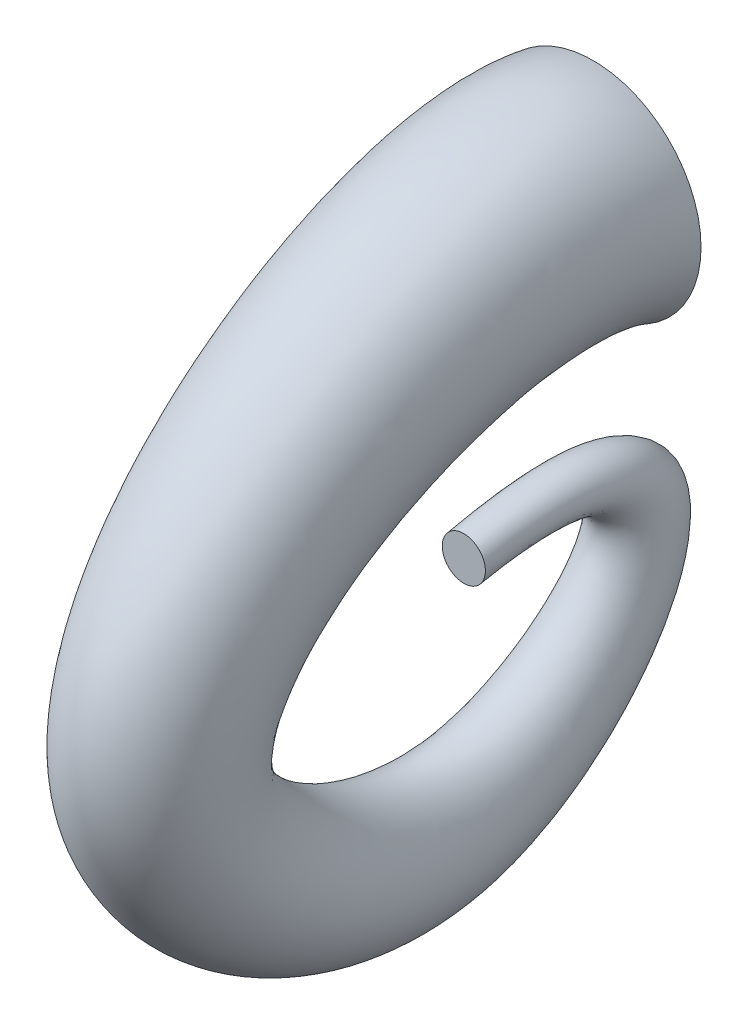
ISO-10303-21;
HEADER;
FILE_DESCRIPTION(('STEP AP214'),'2;1');
FILE_NAME('part.step','',(''),(''),'','','');
FILE_SCHEMA(('AUTOMOTIVE_DESIGN { 1 0 10303 214 1 1 1 1 }'));
ENDSEC;
DATA;
#1=APPLICATION_CONTEXT('core data for automotive mechanical design processes');
#2=APPLICATION_PROTOCOL_DEFINITION('international standard','automotive_design',2000,#1);
#3=PRODUCT_CONTEXT('',#1,'mechanical');
#4=PRODUCT('Part','Part','',(#3));
#5=PRODUCT_RELATED_PRODUCT_CATEGORY('part','',(#4));
#6=PRODUCT_DEFINITION_FORMATION('','',#4);
#7=PRODUCT_DEFINITION_CONTEXT('part definition',#1,'design');
#8=PRODUCT_DEFINITION('design','',#6,#7);
#9=PRODUCT_DEFINITION_SHAPE('','',#8);
#10=(LENGTH_UNIT() NAMED_UNIT(*) SI_UNIT(.MILLI.,.METRE.));
#11=(NAMED_UNIT(*) PLANE_ANGLE_UNIT() SI_UNIT($,.RADIAN.));
#12=(NAMED_UNIT(*) SI_UNIT($,.STERADIAN.) SOLID_ANGLE_UNIT());
#13=UNCERTAINTY_MEASURE_WITH_UNIT(LENGTH_MEASURE(1.E-05),#10,'distance_accuracy_value','');
#14=(GEOMETRIC_REPRESENTATION_CONTEXT(3) GLOBAL_UNCERTAINTY_ASSIGNED_CONTEXT((#13)) GLOBAL_UNIT_ASSIGNED_CONTEXT((#10,
#11,#12)) REPRESENTATION_CONTEXT('',''));
#15=CARTESIAN_POINT('',(0.,0.,0.));
#16=DIRECTION('',(0.,0.,1.));
#17=DIRECTION('',(1.,0.,0.));
#18=AXIS2_PLACEMENT_3D('',#15,#16,#17);
#19=CARTESIAN_POINT('',(0.,88.9,-38.1));
#20=DIRECTION('',(0.,0.,1.));
#21=DIRECTION('',(1.,0.,0.));
#22=AXIS2_PLACEMENT_3D('',#19,#20,#21);
#23=PLANE('',#22);
#24=CARTESIAN_POINT('',(0.,88.9,-38.1));
#25=DIRECTION('',(0.,0.,1.));
#26=DIRECTION('',(1.,0.,0.));
#27=AXIS2_PLACEMENT_3D('',#24,#25,#26);
#28=CIRCLE('',#27,31.75);
#29=CARTESIAN_POINT('',(31.75,88.9,-38.1));
#30=VERTEX_POINT('',#29);
#31=EDGE_CURVE('E12',#30,#30,#28,.T.);
#32=ORIENTED_EDGE('',*,*,#31,.F.);
#33=EDGE_LOOP('',(#32));
#34=FACE_BOUND('',#33,.T.);
#35=ADVANCED_FACE('F88',(#34),#23,.F.);
#36=CARTESIAN_POINT('',(0.,0.,0.));
#37=DIRECTION('',(0.,0.,1.));
#38=DIRECTION('',(1.,0.,0.));
#39=AXIS2_PLACEMENT_3D('',#36,#37,#38);
#40=PLANE('',#39);
#41=CARTESIAN_POINT('',(0.,12.7,0.));
#42=DIRECTION('',(0.,0.,1.));
#43=DIRECTION('',(1.,0.,0.));
#44=AXIS2_PLACEMENT_3D('',#41,#42,#43);
#45=CIRCLE('',#44,6.35);
#46=CARTESIAN_POINT('',(6.35,12.7,0.));
#47=VERTEX_POINT('',#46);
#48=EDGE_CURVE('E96',#47,#47,#45,.T.);
#49=ORIENTED_EDGE('',*,*,#48,.T.);
#50=EDGE_LOOP('',(#49));
#51=FACE_BOUND('',#50,.T.);
#52=ADVANCED_FACE('F120',(#51),#40,.T.);
#53=CARTESIAN_POINT('',(0.,19.05,0.));
#54=CARTESIAN_POINT('',(0.,39.5023173920752,-103.794441428933));
#55=CARTESIAN_POINT('',(0.,-50.7782227189179,-60.6401874218214));
#56=CARTESIAN_POINT('',(0.,-83.2418300528822,42.1533021035655));
#57=CARTESIAN_POINT('',(0.,-46.8916623747579,100.510959947666));
#58=CARTESIAN_POINT('',(0.,60.4833470880495,133.275887320275));
#59=CARTESIAN_POINT('',(0.,135.476895126784,24.4103513130446));
#60=CARTESIAN_POINT('',(0.,120.65,-38.1));
#61=CARTESIAN_POINT('',(0.415606524814644,19.05,0.));
#62=CARTESIAN_POINT('',(0.588506252056333,39.5023173920752,-103.794441428933));
#63=CARTESIAN_POINT('',(0.766979328931513,-50.7782227189179,-60.6401874218214));
#64=CARTESIAN_POINT('',(1.07901934399031,-83.2418300528822,42.1533021035655));
#65=CARTESIAN_POINT('',(1.23336523188843,-46.8916623747579,100.510959947666));
#66=CARTESIAN_POINT('',(1.60903418809944,60.4833470880495,133.275887320275));
#67=CARTESIAN_POINT('',(1.85113620612683,135.476895126784,24.4103513130446));
#68=CARTESIAN_POINT('',(2.07803262407322,120.65,-38.1));
#69=CARTESIAN_POINT('',(1.24673444727475,18.9674430750039,0.));
#70=CARTESIAN_POINT('',(1.76543626701773,39.3919695013015,-103.488030680534));
#71=CARTESIAN_POINT('',(2.30085822069658,-50.5483172481614,-60.4319133687042));
#72=CARTESIAN_POINT('',(3.23698302682409,-82.8384675256928,42.0534996033567));
#73=CARTESIAN_POINT('',(3.70002304545113,-46.6049744878223,100.219012022441));
#74=CARTESIAN_POINT('',(4.82703564585397,60.3620548980935,132.745055095399));
#75=CARTESIAN_POINT('',(5.55334539380815,135.045483844224,24.1494699590034));
#76=CARTESIAN_POINT('',(6.23403810951982,120.240788903065,-38.1));
#77=CARTESIAN_POINT('',(2.44589267626068,18.6051069321988,0.));
#78=CARTESIAN_POINT('',(3.46333302122532,38.9036896448158,-102.224086343391));
#79=CARTESIAN_POINT('',(4.51357012570007,-49.644722411665,-59.5727828995958));
#80=CARTESIAN_POINT('',(6.34979107080545,-81.2397667483422,41.6418142899953));
#81=CARTESIAN_POINT('',(7.25805007116478,-45.4976493386556,99.0147268308891));
#82=CARTESIAN_POINT('',(9.46869989981112,59.7618970921492,130.555372167787));
#83=CARTESIAN_POINT('',(10.8933658878268,133.150253636952,23.0733343735832));
#84=CARTESIAN_POINT('',(12.2285534756239,118.422297617221,-38.1000000000001));
#85=CARTESIAN_POINT('',(3.55023897734567,18.0134400537597,0.));
#86=CARTESIAN_POINT('',(5.02739911964864,38.1058579680826,-100.27071782235));
#87=CARTESIAN_POINT('',(6.55217489483346,-48.3033710187635,-58.2450358109736));
#88=CARTESIAN_POINT('',(9.21807310301371,-78.8449595341722,41.0055733511642));
#89=CARTESIAN_POINT('',(10.5367194500537,-43.8725286425832,97.1535588075813));
#90=CARTESIAN_POINT('',(13.7462283235973,58.7231405356425,127.171316734205));
#91=CARTESIAN_POINT('',(15.8146147641454,130.093884406066,21.4102157415705));
#92=CARTESIAN_POINT('',(17.7530929235308,115.469401275124,-38.0999999999999));
#93=CARTESIAN_POINT('',(4.51949841605828,17.2194795353853,0.));
#94=CARTESIAN_POINT('',(6.39947715830029,37.0321635198874,-97.7428291480631));
#95=CARTESIAN_POINT('',(8.34005622074638,-46.6220602036922,-56.5267748727567));
#96=CARTESIAN_POINT('',(11.7329395086384,-75.8236926890672,40.1822027244414));
#97=CARTESIAN_POINT('',(13.4111780624524,-41.858871353021,94.744988424477));
#98=CARTESIAN_POINT('',(17.4959135508416,57.2613282538139,122.79195087898));
#99=CARTESIAN_POINT('',(20.1283448137849,126.002935389392,19.2579445707303));
#100=CARTESIAN_POINT('',(22.5954420685642,111.495387119073,-38.1000000000001));
#101=CARTESIAN_POINT('',(5.31339605792705,16.2502624727742,0.));
#102=CARTESIAN_POINT('',(7.52411544969849,35.7204067040415,-94.755324351178));
#103=CARTESIAN_POINT('',(9.80609644672775,-44.6902318628429,-54.496102854864));
#104=CARTESIAN_POINT('',(13.7958824533583,-72.3298378313398,39.2091283474055));
#105=CARTESIAN_POINT('',(15.7693699357277,-39.5664910695719,91.8984961535357));
#106=CARTESIAN_POINT('',(20.572724224548,55.4203815978839,117.616336686442));
#107=CARTESIAN_POINT('',(23.6682735037669,121.038101055997,16.7143513688284));
#108=CARTESIAN_POINT('',(26.5694019154756,106.653072956324,-38.1));
#109=CARTESIAN_POINT('',(5.9050471605683,15.1459513294715,0.));
#110=CARTESIAN_POINT('',(8.36135004926656,34.2236068236755,-91.4231074623446));
#111=CARTESIAN_POINT('',(10.896830823453,-42.5799479777133,-52.2311225272145));
#112=CARTESIAN_POINT('',(15.3298325557632,-68.4961083727782,38.1237761576346));
#113=CARTESIAN_POINT('',(17.5225500131649,-37.0821743103364,88.7235624667164));
#114=CARTESIAN_POINT('',(22.8594973702043,53.2717977340854,111.843536240918));
#115=CARTESIAN_POINT('',(26.2989237691199,115.390583147413,13.87726664363));
#116=CARTESIAN_POINT('',(29.5223315542457,101.128531209233,-38.1000000000001));
#117=CARTESIAN_POINT('',(6.26756698159834,13.9467085690224,0.));
#118=CARTESIAN_POINT('',(8.87528796923964,32.5975097784664,-87.8610825122124));
#119=CARTESIAN_POINT('',(11.5670677407933,-40.3577294460212,-49.809936659727));
#120=CARTESIAN_POINT('',(16.2733406148695,-64.4447558283801,36.9635720927072));
#121=CARTESIAN_POINT('',(18.6012275216281,-34.4798116906746,85.3296678359787));
#122=CARTESIAN_POINT('',(24.2671694935744,50.9058939609721,105.672611626739));
#123=CARTESIAN_POINT('',(27.9186183629982,109.274221441297,10.8445209029008));
#124=CARTESIAN_POINT('',(31.3407322120983,95.1340504505981,-38.0999999999999));
#125=CARTESIAN_POINT('',(6.39154407171055,12.7,0.));
#126=CARTESIAN_POINT('',(9.05022975121634,30.9062857109592,-84.1841535314307));
#127=CARTESIAN_POINT('',(11.7946170399371,-38.0805158931082,-47.3106480223206));
#128=CARTESIAN_POINT('',(16.5928682153708,-60.2864275053668,35.7659420902014));
#129=CARTESIAN_POINT('',(18.9662508018668,-31.8206890036803,81.8262927332815));
#130=CARTESIAN_POINT('',(24.7429266245935,48.4280278371076,99.30262492823));
#131=CARTESIAN_POINT('',(28.4657385606072,102.919465507166,7.71394465440593));
#132=CARTESIAN_POINT('',(31.9547334060528,88.9000000000001,-38.1000000000001));
#133=CARTESIAN_POINT('',(6.26756698159833,11.4532914309776,0.));
#134=CARTESIAN_POINT('',(8.87528796923964,29.215061643452,-80.5072245506491));
#135=CARTESIAN_POINT('',(11.5670677407933,-35.8033023401953,-44.8113593849142));
#136=CARTESIAN_POINT('',(16.2733406148695,-56.1280991823537,34.5683120876957));
#137=CARTESIAN_POINT('',(18.6012275216281,-29.161566316686,78.3229176305846));
#138=CARTESIAN_POINT('',(24.2671694935744,45.950161713243,92.9326382297217));
#139=CARTESIAN_POINT('',(27.9186183629982,96.564709573036,4.58336840591136));
#140=CARTESIAN_POINT('',(31.3407322120983,82.6659495494019,-38.0999999999999));
#141=CARTESIAN_POINT('',(5.90504716056829,10.2540486705285,0.));
#142=CARTESIAN_POINT('',(8.36135004926656,27.5889645982429,-76.9451996005168));
#143=CARTESIAN_POINT('',(10.896830823453,-33.5810838085032,-42.3901735174268));
#144=CARTESIAN_POINT('',(15.3298325557632,-52.0767466379556,33.4081080227681));
#145=CARTESIAN_POINT('',(17.5225500131649,-26.5592036970243,74.9290229998467));
#146=CARTESIAN_POINT('',(22.8594973702044,43.5842579401296,86.7617136155415));
#147=CARTESIAN_POINT('',(26.2989237691199,90.4483478669197,1.55062266518186));
#148=CARTESIAN_POINT('',(29.5223315542457,76.6714687907667,-38.1000000000002));
#149=CARTESIAN_POINT('',(5.31339605792705,9.14973752722581,0.));
#150=CARTESIAN_POINT('',(7.52411544969849,26.0921647178769,-73.6129827116834));
#151=CARTESIAN_POINT('',(9.80609644672775,-31.4707999233736,-40.1251931897772));
#152=CARTESIAN_POINT('',(13.7958824533583,-48.2430171793939,32.3227558329974));
#153=CARTESIAN_POINT('',(15.7693699357277,-24.0748869377888,71.7540893130276));
#154=CARTESIAN_POINT('',(20.572724224548,41.4356740763313,80.9889131700184));
#155=CARTESIAN_POINT('',(23.6682735037669,84.8008299583359,-1.28646206001624));
#156=CARTESIAN_POINT('',(26.5694019154756,71.1469270436762,-38.0999999999999));
#157=CARTESIAN_POINT('',(4.51949841605828,8.1805204646147,0.));
#158=CARTESIAN_POINT('',(6.39947715830029,24.780407902031,-70.6254779147984));
#159=CARTESIAN_POINT('',(8.34005622074638,-29.5389715825243,-38.0945211718846));
#160=CARTESIAN_POINT('',(11.7329395086384,-44.7491623216665,31.3496814559614));
#161=CARTESIAN_POINT('',(13.4111780624524,-21.7825066543397,68.9075970420861));
#162=CARTESIAN_POINT('',(17.4959135508416,39.5947274204012,75.8132989774802));
#163=CARTESIAN_POINT('',(20.1283448137849,79.8359956249407,-3.83005526191838));
#164=CARTESIAN_POINT('',(22.5954420685642,66.3046128809273,-38.1000000000001));
#165=CARTESIAN_POINT('',(3.55023897734568,7.38655994624031,0.));
#166=CARTESIAN_POINT('',(5.02739911964866,23.7067134538358,-68.097589240511));
#167=CARTESIAN_POINT('',(6.55217489483348,-27.8576607674529,-36.3762602336677));
#168=CARTESIAN_POINT('',(9.21807310301374,-41.7278954765614,30.5263108292387));
#169=CARTESIAN_POINT('',(10.5367194500537,-19.7688493647772,66.4990266589819));
#170=CARTESIAN_POINT('',(13.7462283235973,38.1329151385729,71.4339331222557));
#171=CARTESIAN_POINT('',(15.8146147641454,75.7450466082674,-5.98232643275849));
#172=CARTESIAN_POINT('',(17.7530929235309,62.3305987248769,-38.1));
#173=CARTESIAN_POINT('',(2.44589267626069,6.79489306780125,0.));
#174=CARTESIAN_POINT('',(3.46333302122534,22.9088817771025,-66.1442207194707));
#175=CARTESIAN_POINT('',(4.51357012570009,-26.5163093745516,-35.0485131450455));
#176=CARTESIAN_POINT('',(6.34979107080547,-39.3330882623917,29.8900698904075));
#177=CARTESIAN_POINT('',(7.2580500711648,-18.1437286687053,64.6378586356741));
#178=CARTESIAN_POINT('',(9.46869989981114,37.0941585820656,68.0498776886731));
#179=CARTESIAN_POINT('',(10.8933658878269,72.6886773773797,-7.64544506477123));
#180=CARTESIAN_POINT('',(12.228553475624,59.3777023827785,-38.0999999999999));
#181=CARTESIAN_POINT('',(1.24673444727475,6.43255692499607,0.));
#182=CARTESIAN_POINT('',(1.76543626701774,22.4206019206169,-64.880276382327));
#183=CARTESIAN_POINT('',(2.30085822069659,-25.612714538055,-34.1893826759371));
#184=CARTESIAN_POINT('',(3.2369830268241,-37.7343874850407,29.4783845770461));
#185=CARTESIAN_POINT('',(3.70002304545113,-17.0364035195382,63.433573444122));
#186=CARTESIAN_POINT('',(4.82703564585398,36.4940007761218,65.8601947610608));
#187=CARTESIAN_POINT('',(5.55334539380815,70.7934471701092,-8.72158065019142));
#188=CARTESIAN_POINT('',(6.23403810951982,57.5592110969355,-38.1000000000001));
#189=CARTESIAN_POINT('',(0.415606524814642,6.35,0.));
#190=CARTESIAN_POINT('',(0.588506252056332,22.3102540298431,-64.5738656339285));
#191=CARTESIAN_POINT('',(0.766979328931513,-25.3828090672987,-33.9811086228199));
#192=CARTESIAN_POINT('',(1.07901934399031,-37.3310249578515,29.3785820768373));
#193=CARTESIAN_POINT('',(1.23336523188843,-16.7497156326027,63.1416255188972));
#194=CARTESIAN_POINT('',(1.60903418809944,36.3727085861657,65.3293625361851));
#195=CARTESIAN_POINT('',(1.85113620612683,70.3620358875482,-8.9824620042326));
#196=CARTESIAN_POINT('',(2.07803262407321,57.15,-38.1));
#197=CARTESIAN_POINT('',(-0.415606524814645,6.35,0.));
#198=CARTESIAN_POINT('',(-0.588506252056332,22.3102540298431,-64.5738656339285));
#199=CARTESIAN_POINT('',(-0.766979328931513,-25.3828090672987,-33.9811086228199));
#200=CARTESIAN_POINT('',(-1.07901934399031,-37.3310249578515,29.3785820768373));
#201=CARTESIAN_POINT('',(-1.23336523188843,-16.7497156326027,63.1416255188972));
#202=CARTESIAN_POINT('',(-1.60903418809944,36.3727085861657,65.3293625361851));
#203=CARTESIAN_POINT('',(-1.85113620612683,70.3620358875482,-8.9824620042326));
#204=CARTESIAN_POINT('',(-2.07803262407322,57.15,-38.1));
#205=CARTESIAN_POINT('',(-1.24673444727475,6.43255692499607,0.));
#206=CARTESIAN_POINT('',(-1.76543626701773,22.4206019206169,-64.8802763823269));
#207=CARTESIAN_POINT('',(-2.30085822069658,-25.612714538055,-34.189382675937));
#208=CARTESIAN_POINT('',(-3.23698302682409,-37.7343874850407,29.4783845770462));
#209=CARTESIAN_POINT('',(-3.70002304545113,-17.0364035195381,63.433573444122));
#210=CARTESIAN_POINT('',(-4.82703564585397,36.4940007761219,65.8601947610609));
#211=CARTESIAN_POINT('',(-5.55334539380815,70.7934471701093,-8.72158065019129));
#212=CARTESIAN_POINT('',(-6.23403810951983,57.5592110969355,-38.0999999999999));
#213=CARTESIAN_POINT('',(-2.44589267626068,6.79489306780124,0.));
#214=CARTESIAN_POINT('',(-3.46333302122532,22.9088817771025,-66.1442207194707));
#215=CARTESIAN_POINT('',(-4.51357012570006,-26.5163093745516,-35.0485131450455));
#216=CARTESIAN_POINT('',(-6.34979107080543,-39.3330882623917,29.8900698904075));
#217=CARTESIAN_POINT('',(-7.25805007116475,-18.1437286687053,64.637858635674));
#218=CARTESIAN_POINT('',(-9.46869989981108,37.0941585820655,68.049877688673));
#219=CARTESIAN_POINT('',(-10.8933658878268,72.6886773773796,-7.64544506477141));
#220=CARTESIAN_POINT('',(-12.2285534756239,59.3777023827784,-38.1000000000001));
#221=CARTESIAN_POINT('',(-3.55023897734568,7.38655994624032,0.));
#222=CARTESIAN_POINT('',(-5.02739911964865,23.7067134538358,-68.0975892405109));
#223=CARTESIAN_POINT('',(-6.55217489483348,-27.8576607674529,-36.3762602336676));
#224=CARTESIAN_POINT('',(-9.21807310301374,-41.7278954765614,30.5263108292388));
#225=CARTESIAN_POINT('',(-10.5367194500537,-19.7688493647772,66.499026658982));
#226=CARTESIAN_POINT('',(-13.7462283235973,38.1329151385729,71.4339331222558));
#227=CARTESIAN_POINT('',(-15.8146147641454,75.7450466082673,-5.98232643275832));
#228=CARTESIAN_POINT('',(-17.7530929235309,62.3305987248769,-38.0999999999998));
#229=CARTESIAN_POINT('',(-4.51949841605829,8.18052046461471,0.));
#230=CARTESIAN_POINT('',(-6.39947715830029,24.780407902031,-70.6254779147983));
#231=CARTESIAN_POINT('',(-8.34005622074638,-29.5389715825243,-38.0945211718846));
#232=CARTESIAN_POINT('',(-11.7329395086384,-44.7491623216664,31.3496814559613));
#233=CARTESIAN_POINT('',(-13.4111780624524,-21.7825066543396,68.9075970420861));
#234=CARTESIAN_POINT('',(-17.4959135508416,39.5947274204013,75.8132989774801));
#235=CARTESIAN_POINT('',(-20.1283448137849,79.8359956249408,-3.83005526191846));
#236=CARTESIAN_POINT('',(-22.5954420685642,66.3046128809274,-38.1000000000001));
#237=CARTESIAN_POINT('',(-5.31339605792704,9.1497375272258,0.));
#238=CARTESIAN_POINT('',(-7.52411544969848,26.0921647178769,-73.6129827116834));
#239=CARTESIAN_POINT('',(-9.80609644672774,-31.4707999233737,-40.1251931897773));
#240=CARTESIAN_POINT('',(-13.7958824533583,-48.243017179394,32.3227558329973));
#241=CARTESIAN_POINT('',(-15.7693699357277,-24.0748869377889,71.7540893130276));
#242=CARTESIAN_POINT('',(-20.5727242245479,41.4356740763311,80.9889131700183));
#243=CARTESIAN_POINT('',(-23.6682735037668,84.8008299583357,-1.28646206001635));
#244=CARTESIAN_POINT('',(-26.5694019154755,71.146927043676,-38.1));
#245=CARTESIAN_POINT('',(-5.90504716056828,10.2540486705285,0.));
#246=CARTESIAN_POINT('',(-8.36135004926655,27.5889645982429,-76.9451996005168));
#247=CARTESIAN_POINT('',(-10.8968308234529,-33.5810838085032,-42.3901735174268));
#248=CARTESIAN_POINT('',(-15.3298325557632,-52.0767466379554,33.4081080227682));
#249=CARTESIAN_POINT('',(-17.5225500131649,-26.5592036970241,74.9290229998468));
#250=CARTESIAN_POINT('',(-22.8594973702043,43.5842579401299,86.7617136155416));
#251=CARTESIAN_POINT('',(-26.2989237691199,90.44834786692,1.55062266518203));
#252=CARTESIAN_POINT('',(-29.5223315542457,76.6714687907671,-38.1));
#253=CARTESIAN_POINT('',(-6.26756698159834,11.4532914309776,0.));
#254=CARTESIAN_POINT('',(-8.87528796923965,29.215061643452,-80.507224550649));
#255=CARTESIAN_POINT('',(-11.5670677407933,-35.8033023401953,-44.8113593849143));
#256=CARTESIAN_POINT('',(-16.2733406148696,-56.1280991823537,34.5683120876956));
#257=CARTESIAN_POINT('',(-18.6012275216281,-29.1615663166861,78.3229176305846));
#258=CARTESIAN_POINT('',(-24.2671694935745,45.9501617132429,92.9326382297216));
#259=CARTESIAN_POINT('',(-27.9186183629983,96.5647095730359,4.58336840591121));
#260=CARTESIAN_POINT('',(-31.3407322120984,82.6659495494018,-38.1000000000001));
#261=CARTESIAN_POINT('',(-6.39154407171057,12.7,0.));
#262=CARTESIAN_POINT('',(-9.05022975121634,30.9062857109592,-84.1841535314307));
#263=CARTESIAN_POINT('',(-11.7946170399371,-38.0805158931083,-47.3106480223206));
#264=CARTESIAN_POINT('',(-16.5928682153707,-60.2864275053669,35.7659420902014));
#265=CARTESIAN_POINT('',(-18.9662508018667,-31.8206890036804,81.8262927332817));
#266=CARTESIAN_POINT('',(-24.7429266245934,48.4280278371075,99.3026249282301));
#267=CARTESIAN_POINT('',(-28.4657385606071,102.919465507166,7.71394465440603));
#268=CARTESIAN_POINT('',(-31.9547334060527,88.8999999999999,-38.1));
#269=CARTESIAN_POINT('',(-6.26756698159833,13.9467085690224,0.));
#270=CARTESIAN_POINT('',(-8.87528796923965,32.5975097784664,-87.8610825122123));
#271=CARTESIAN_POINT('',(-11.5670677407933,-40.3577294460212,-49.8099366597271));
#272=CARTESIAN_POINT('',(-16.2733406148696,-64.44475582838,36.9635720927072));
#273=CARTESIAN_POINT('',(-18.6012275216281,-34.4798116906746,85.3296678359788));
#274=CARTESIAN_POINT('',(-24.2671694935745,50.9058939609722,105.672611626738));
#275=CARTESIAN_POINT('',(-27.9186183629983,109.274221441297,10.8445209029007));
#276=CARTESIAN_POINT('',(-31.3407322120984,95.1340504505982,-38.1));
#277=CARTESIAN_POINT('',(-5.90504716056827,15.1459513294715,0.));
#278=CARTESIAN_POINT('',(-8.36135004926654,34.2236068236754,-91.4231074623446));
#279=CARTESIAN_POINT('',(-10.8968308234529,-42.5799479777133,-52.2311225272145));
#280=CARTESIAN_POINT('',(-15.3298325557632,-68.4961083727783,38.1237761576346));
#281=CARTESIAN_POINT('',(-17.5225500131649,-37.0821743103366,88.7235624667166));
#282=CARTESIAN_POINT('',(-22.8594973702043,53.2717977340851,111.843536240919));
#283=CARTESIAN_POINT('',(-26.2989237691199,115.390583147412,13.87726664363));
#284=CARTESIAN_POINT('',(-29.5223315542457,101.128531209233,-38.1));
#285=CARTESIAN_POINT('',(-5.31339605792704,16.2502624727742,0.));
#286=CARTESIAN_POINT('',(-7.5241154496985,35.7204067040415,-94.7553243511779));
#287=CARTESIAN_POINT('',(-9.80609644672777,-44.6902318628428,-54.496102854864));
#288=CARTESIAN_POINT('',(-13.7958824533584,-72.3298378313397,39.2091283474055));
#289=CARTESIAN_POINT('',(-15.7693699357278,-39.5664910695717,91.8984961535358));
#290=CARTESIAN_POINT('',(-20.572724224548,55.4203815978841,117.616336686442));
#291=CARTESIAN_POINT('',(-23.6682735037669,121.038101055997,16.7143513688284));
#292=CARTESIAN_POINT('',(-26.5694019154756,106.653072956324,-38.1));
#293=CARTESIAN_POINT('',(-4.5194984160583,17.2194795353853,0.));
#294=CARTESIAN_POINT('',(-6.39947715830029,37.0321635198873,-97.742829148063));
#295=CARTESIAN_POINT('',(-8.34005622074638,-46.6220602036922,-56.5267748727567));
#296=CARTESIAN_POINT('',(-11.7329395086384,-75.8236926890674,40.1822027244414));
#297=CARTESIAN_POINT('',(-13.4111780624524,-41.8588713530212,94.7449884244772));
#298=CARTESIAN_POINT('',(-17.4959135508416,57.2613282538135,122.79195087898));
#299=CARTESIAN_POINT('',(-20.1283448137849,126.002935389391,19.2579445707303));
#300=CARTESIAN_POINT('',(-22.5954420685641,111.495387119072,-38.1));
#301=CARTESIAN_POINT('',(-3.55023897734568,18.0134400537597,0.));
#302=CARTESIAN_POINT('',(-5.02739911964866,38.1058579680827,-100.27071782235));
#303=CARTESIAN_POINT('',(-6.55217489483348,-48.3033710187634,-58.2450358109736));
#304=CARTESIAN_POINT('',(-9.21807310301375,-78.8449595341721,41.0055733511641));
#305=CARTESIAN_POINT('',(-10.5367194500537,-43.8725286425832,97.1535588075814));
#306=CARTESIAN_POINT('',(-13.7462283235973,58.7231405356426,127.171316734204));
#307=CARTESIAN_POINT('',(-15.8146147641455,130.093884406066,21.4102157415704));
#308=CARTESIAN_POINT('',(-17.7530929235309,115.469401275124,-38.1));
#309=CARTESIAN_POINT('',(-2.44589267626067,18.6051069321988,0.));
#310=CARTESIAN_POINT('',(-3.46333302122532,38.9036896448158,-102.224086343391));
#311=CARTESIAN_POINT('',(-4.51357012570006,-49.644722411665,-59.5727828995958));
#312=CARTESIAN_POINT('',(-6.34979107080543,-81.2397667483422,41.6418142899953));
#313=CARTESIAN_POINT('',(-7.25805007116475,-45.4976493386556,99.0147268308892));
#314=CARTESIAN_POINT('',(-9.46869989981108,59.7618970921493,130.555372167787));
#315=CARTESIAN_POINT('',(-10.8933658878268,133.150253636953,23.0733343735833));
#316=CARTESIAN_POINT('',(-12.2285534756239,118.422297617221,-38.1));
#317=CARTESIAN_POINT('',(-1.24673444727475,18.9674430750039,0.));
#318=CARTESIAN_POINT('',(-1.76543626701773,39.3919695013015,-103.488030680534));
#319=CARTESIAN_POINT('',(-2.30085822069659,-50.5483172481614,-60.4319133687042));
#320=CARTESIAN_POINT('',(-3.2369830268241,-82.8384675256929,42.0534996033567));
#321=CARTESIAN_POINT('',(-3.70002304545114,-46.6049744878224,100.219012022441));
#322=CARTESIAN_POINT('',(-4.82703564585399,60.3620548980934,132.745055095399));
#323=CARTESIAN_POINT('',(-5.55334539380817,135.045483844223,24.1494699590034));
#324=CARTESIAN_POINT('',(-6.23403810951984,120.240788903065,-38.1));
#325=CARTESIAN_POINT('',(-0.415606524814643,19.05,0.));
#326=CARTESIAN_POINT('',(-0.588506252056333,39.5023173920752,-103.794441428933));
#327=CARTESIAN_POINT('',(-0.766979328931513,-50.7782227189179,-60.6401874218214));
#328=CARTESIAN_POINT('',(-1.07901934399031,-83.2418300528822,42.1533021035655));
#329=CARTESIAN_POINT('',(-1.23336523188843,-46.8916623747579,100.510959947666));
#330=CARTESIAN_POINT('',(-1.60903418809944,60.4833470880495,133.275887320275));
#331=CARTESIAN_POINT('',(-1.85113620612683,135.476895126784,24.4103513130446));
#332=CARTESIAN_POINT('',(-2.07803262407322,120.65,-38.1));
#333=CARTESIAN_POINT('',(0.,19.05,0.));
#334=CARTESIAN_POINT('',(0.,39.5023173920752,-103.794441428933));
#335=CARTESIAN_POINT('',(0.,-50.7782227189179,-60.6401874218214));
#336=CARTESIAN_POINT('',(0.,-83.2418300528822,42.1533021035655));
#337=CARTESIAN_POINT('',(0.,-46.8916623747579,100.510959947666));
#338=CARTESIAN_POINT('',(0.,60.4833470880495,133.275887320275));
#339=CARTESIAN_POINT('',(0.,135.476895126784,24.4103513130446));
#340=CARTESIAN_POINT('',(0.,120.65,-38.1));
#341=B_SPLINE_SURFACE_WITH_KNOTS('',3,3,((#53,#54,#55,#56,#57,#58,#59,#60),(#61,#62,#63,#64,#65,
#66,#67,#68),(#69,#70,#71,#72,#73,#74,#75,#76),(#77,#78,#79,#80,#81,#82,#83,#84),(#85,#86,#87,
#88,#89,#90,#91,#92),(#93,#94,#95,#96,#97,#98,#99,#100),(#101,#102,#103,#104,#105,#106,#107,
#108),(#109,#110,#111,#112,#113,#114,#115,#116),(#117,#118,#119,#120,#121,#122,#123,#124),(#125,
#126,#127,#128,#129,#130,#131,#132),(#133,#134,#135,#136,#137,#138,#139,#140),(#141,#142,#143,
#144,#145,#146,#147,#148),(#149,#150,#151,#152,#153,#154,#155,#156),(#157,#158,#159,#160,#161,
#162,#163,#164),(#165,#166,#167,#168,#169,#170,#171,#172),(#173,#174,#175,#176,#177,#178,#179,
#180),(#181,#182,#183,#184,#185,#186,#187,#188),(#189,#190,#191,#192,#193,#194,#195,#196),(#197,
#198,#199,#200,#201,#202,#203,#204),(#205,#206,#207,#208,#209,#210,#211,#212),(#213,#214,#215,
#216,#217,#218,#219,#220),(#221,#222,#223,#224,#225,#226,#227,#228),(#229,#230,#231,#232,#233,
#234,#235,#236),(#237,#238,#239,#240,#241,#242,#243,#244),(#245,#246,#247,#248,#249,#250,#251,
#252),(#253,#254,#255,#256,#257,#258,#259,#260),(#261,#262,#263,#264,#265,#266,#267,#268),(#269,
#270,#271,#272,#273,#274,#275,#276),(#277,#278,#279,#280,#281,#282,#283,#284),(#285,#286,#287,
#288,#289,#290,#291,#292),(#293,#294,#295,#296,#297,#298,#299,#300),(#301,#302,#303,#304,#305,
#306,#307,#308),(#309,#310,#311,#312,#313,#314,#315,#316),(#317,#318,#319,#320,#321,#322,#323,
#324),(#325,#326,#327,#328,#329,#330,#331,#332),(#333,#334,#335,#336,#337,#338,#339,#340)),
.UNSPECIFIED.,.T.,.F.,.F.,(4,1,1,1,1,1,1,1,1,1,1,1,1,1,1,1,2,1,1,1,1,1,1,1,1,1,1,1,1,1,1,1,4),
(4,1,1,1,1,4),(0.,0.03125,0.0625,0.09375,0.125,0.15625,0.1875,0.21875,0.25,0.28125,0.3125,
0.34375,0.375,0.40625,0.4375,0.46875,0.5,0.53125,0.5625,0.59375,0.625,0.65625,0.6875,0.71875,
0.75,0.78125,0.8125,0.84375,0.875,0.90625,0.9375,0.96875,1.),(0.,0.312013377290216,
0.322070996638187,0.563104757314562,0.590544653899065,1.),.UNSPECIFIED.);
#342=ORIENTED_EDGE('',*,*,#48,.F.);
#343=EDGE_LOOP('',(#342));
#344=FACE_BOUND('',#343,.T.);
#345=ORIENTED_EDGE('',*,*,#31,.T.);
#346=EDGE_LOOP('',(#345));
#347=FACE_BOUND('',#346,.T.);
#348=ADVANCED_FACE('F128',(#344,#347),#341,.T.);
#349=CLOSED_SHELL('',(#35,#52,#348));
#350=MANIFOLD_SOLID_BREP('B2',#349);
#351=ADVANCED_BREP_SHAPE_REPRESENTATION('',(#18,#350),#14);
#352=SHAPE_DEFINITION_REPRESENTATION(#9,#351);
ENDSEC;
END-ISO-10303-21;
